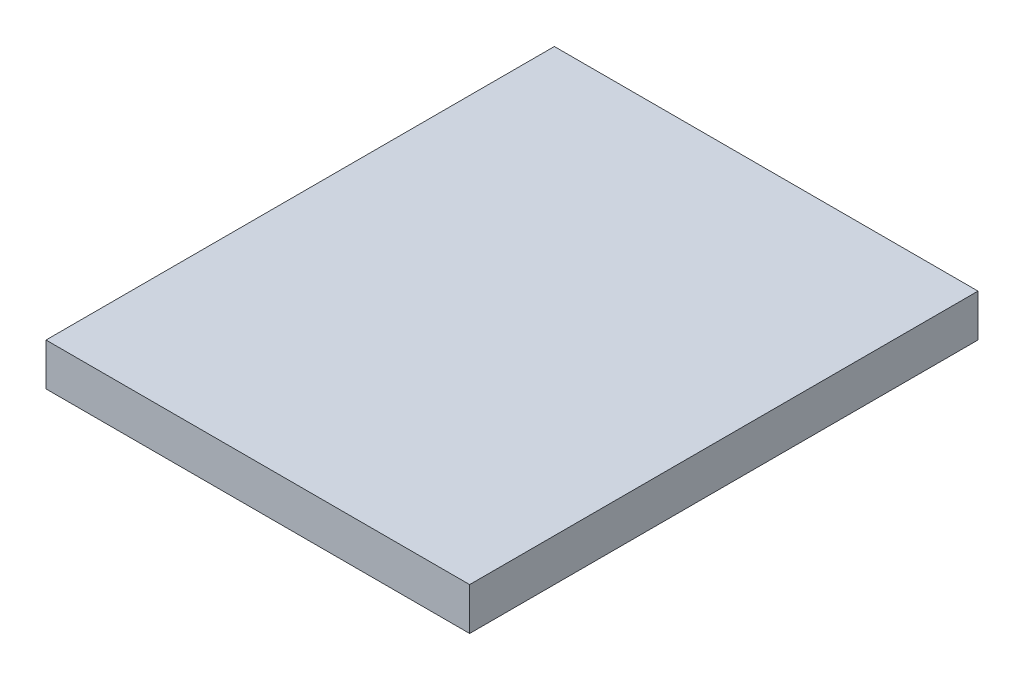
ISO-10303-21;
HEADER;
FILE_DESCRIPTION(('STEP AP214'),'2;1');
FILE_NAME('part.step','',(''),(''),'','','');
FILE_SCHEMA(('AUTOMOTIVE_DESIGN { 1 0 10303 214 1 1 1 1 }'));
ENDSEC;
DATA;
#1=APPLICATION_CONTEXT('core data for automotive mechanical design processes');
#2=APPLICATION_PROTOCOL_DEFINITION('international standard','automotive_design',2000,#1);
#3=PRODUCT_CONTEXT('',#1,'mechanical');
#4=PRODUCT('Part','Part','',(#3));
#5=PRODUCT_RELATED_PRODUCT_CATEGORY('part','',(#4));
#6=PRODUCT_DEFINITION_FORMATION('','',#4);
#7=PRODUCT_DEFINITION_CONTEXT('part definition',#1,'design');
#8=PRODUCT_DEFINITION('design','',#6,#7);
#9=PRODUCT_DEFINITION_SHAPE('','',#8);
#10=(LENGTH_UNIT() NAMED_UNIT(*) SI_UNIT(.MILLI.,.METRE.));
#11=(NAMED_UNIT(*) PLANE_ANGLE_UNIT() SI_UNIT($,.RADIAN.));
#12=(NAMED_UNIT(*) SI_UNIT($,.STERADIAN.) SOLID_ANGLE_UNIT());
#13=UNCERTAINTY_MEASURE_WITH_UNIT(LENGTH_MEASURE(1.E-05),#10,'distance_accuracy_value','');
#14=(GEOMETRIC_REPRESENTATION_CONTEXT(3) GLOBAL_UNCERTAINTY_ASSIGNED_CONTEXT((#13)) GLOBAL_UNIT_ASSIGNED_CONTEXT((#10,
#11,#12)) REPRESENTATION_CONTEXT('',''));
#15=CARTESIAN_POINT('',(0.,0.,0.));
#16=DIRECTION('',(0.,0.,1.));
#17=DIRECTION('',(1.,0.,0.));
#18=AXIS2_PLACEMENT_3D('',#15,#16,#17);
#19=CARTESIAN_POINT('',(0.,1.5875,0.));
#20=DIRECTION('',(1.,0.,0.));
#21=DIRECTION('',(0.,0.,-1.));
#22=AXIS2_PLACEMENT_3D('',#19,#20,#21);
#23=PLANE('',#22);
#24=DIRECTION('',(0.,0.,1.));
#25=VECTOR('',#24,1.);
#26=CARTESIAN_POINT('',(0.,0.,0.));
#27=LINE('',#26,#25);
#28=CARTESIAN_POINT('',(0.,0.,-19.05));
#29=VERTEX_POINT('',#28);
#30=CARTESIAN_POINT('',(0.,0.,0.));
#31=VERTEX_POINT('',#30);
#32=EDGE_CURVE('E96',#29,#31,#27,.T.);
#33=ORIENTED_EDGE('',*,*,#32,.T.);
#34=DIRECTION('',(0.,-1.,0.));
#35=VECTOR('',#34,1.);
#36=CARTESIAN_POINT('',(0.,1.5875,0.));
#37=LINE('',#36,#35);
#38=CARTESIAN_POINT('',(0.,1.5875,0.));
#39=VERTEX_POINT('',#38);
#40=EDGE_CURVE('E11',#39,#31,#37,.T.);
#41=ORIENTED_EDGE('',*,*,#40,.F.);
#42=DIRECTION('',(0.,0.,1.));
#43=VECTOR('',#42,1.);
#44=CARTESIAN_POINT('',(0.,1.5875,0.));
#45=LINE('',#44,#43);
#46=CARTESIAN_POINT('',(0.,1.5875,-19.05));
#47=VERTEX_POINT('',#46);
#48=EDGE_CURVE('E84',#47,#39,#45,.T.);
#49=ORIENTED_EDGE('',*,*,#48,.F.);
#50=DIRECTION('',(0.,-1.,0.));
#51=VECTOR('',#50,1.);
#52=CARTESIAN_POINT('',(0.,1.5875,-19.05));
#53=LINE('',#52,#51);
#54=EDGE_CURVE('E92',#47,#29,#53,.T.);
#55=ORIENTED_EDGE('',*,*,#54,.T.);
#56=EDGE_LOOP('',(#33,#41,#49,#55));
#57=FACE_BOUND('',#56,.T.);
#58=ADVANCED_FACE('F33',(#57),#23,.F.);
#59=CARTESIAN_POINT('',(0.,1.5875,0.));
#60=DIRECTION('',(0.,0.,-1.));
#61=DIRECTION('',(-1.,0.,0.));
#62=AXIS2_PLACEMENT_3D('',#59,#60,#61);
#63=PLANE('',#62);
#64=DIRECTION('',(1.,0.,0.));
#65=VECTOR('',#64,1.);
#66=CARTESIAN_POINT('',(0.,0.,0.));
#67=LINE('',#66,#65);
#68=CARTESIAN_POINT('',(15.875,0.,0.));
#69=VERTEX_POINT('',#68);
#70=EDGE_CURVE('E88',#31,#69,#67,.T.);
#71=ORIENTED_EDGE('',*,*,#70,.T.);
#72=DIRECTION('',(0.,-1.,0.));
#73=VECTOR('',#72,1.);
#74=CARTESIAN_POINT('',(15.875,1.5875,0.));
#75=LINE('',#74,#73);
#76=CARTESIAN_POINT('',(15.875,1.5875,0.));
#77=VERTEX_POINT('',#76);
#78=EDGE_CURVE('E41',#77,#69,#75,.T.);
#79=ORIENTED_EDGE('',*,*,#78,.F.);
#80=DIRECTION('',(1.,0.,0.));
#81=VECTOR('',#80,1.);
#82=CARTESIAN_POINT('',(0.,1.5875,0.));
#83=LINE('',#82,#81);
#84=EDGE_CURVE('E79',#39,#77,#83,.T.);
#85=ORIENTED_EDGE('',*,*,#84,.F.);
#86=ORIENTED_EDGE('',*,*,#40,.T.);
#87=EDGE_LOOP('',(#71,#79,#85,#86));
#88=FACE_BOUND('',#87,.T.);
#89=ADVANCED_FACE('F87',(#88),#63,.F.);
#90=CARTESIAN_POINT('',(15.875,1.5875,0.));
#91=DIRECTION('',(-1.,0.,0.));
#92=DIRECTION('',(0.,0.,1.));
#93=AXIS2_PLACEMENT_3D('',#90,#91,#92);
#94=PLANE('',#93);
#95=DIRECTION('',(0.,0.,-1.));
#96=VECTOR('',#95,1.);
#97=CARTESIAN_POINT('',(15.875,0.,0.));
#98=LINE('',#97,#96);
#99=CARTESIAN_POINT('',(15.875,0.,-19.05));
#100=VERTEX_POINT('',#99);
#101=EDGE_CURVE('E66',#69,#100,#98,.T.);
#102=ORIENTED_EDGE('',*,*,#101,.T.);
#103=DIRECTION('',(0.,-1.,0.));
#104=VECTOR('',#103,1.);
#105=CARTESIAN_POINT('',(15.875,1.5875,-19.05));
#106=LINE('',#105,#104);
#107=CARTESIAN_POINT('',(15.875,1.5875,-19.05));
#108=VERTEX_POINT('',#107);
#109=EDGE_CURVE('E89',#108,#100,#106,.T.);
#110=ORIENTED_EDGE('',*,*,#109,.F.);
#111=DIRECTION('',(0.,0.,-1.));
#112=VECTOR('',#111,1.);
#113=CARTESIAN_POINT('',(15.875,1.5875,0.));
#114=LINE('',#113,#112);
#115=EDGE_CURVE('E82',#77,#108,#114,.T.);
#116=ORIENTED_EDGE('',*,*,#115,.F.);
#117=ORIENTED_EDGE('',*,*,#78,.T.);
#118=EDGE_LOOP('',(#102,#110,#116,#117));
#119=FACE_BOUND('',#118,.T.);
#120=ADVANCED_FACE('F90',(#119),#94,.F.);
#121=CARTESIAN_POINT('',(0.,1.5875,-19.05));
#122=DIRECTION('',(0.,0.,1.));
#123=DIRECTION('',(1.,0.,0.));
#124=AXIS2_PLACEMENT_3D('',#121,#122,#123);
#125=PLANE('',#124);
#126=DIRECTION('',(-1.,0.,0.));
#127=VECTOR('',#126,1.);
#128=CARTESIAN_POINT('',(0.,0.,-19.05));
#129=LINE('',#128,#127);
#130=EDGE_CURVE('E72',#100,#29,#129,.T.);
#131=ORIENTED_EDGE('',*,*,#130,.T.);
#132=ORIENTED_EDGE('',*,*,#54,.F.);
#133=DIRECTION('',(-1.,0.,0.));
#134=VECTOR('',#133,1.);
#135=CARTESIAN_POINT('',(0.,1.5875,-19.05));
#136=LINE('',#135,#134);
#137=EDGE_CURVE('E49',#108,#47,#136,.T.);
#138=ORIENTED_EDGE('',*,*,#137,.F.);
#139=ORIENTED_EDGE('',*,*,#109,.T.);
#140=EDGE_LOOP('',(#131,#132,#138,#139));
#141=FACE_BOUND('',#140,.T.);
#142=ADVANCED_FACE('F103',(#141),#125,.F.);
#143=CARTESIAN_POINT('',(0.,1.5875,0.));
#144=DIRECTION('',(0.,-1.,0.));
#145=DIRECTION('',(0.,0.,-1.));
#146=AXIS2_PLACEMENT_3D('',#143,#144,#145);
#147=PLANE('',#146);
#148=ORIENTED_EDGE('',*,*,#48,.T.);
#149=ORIENTED_EDGE('',*,*,#84,.T.);
#150=ORIENTED_EDGE('',*,*,#115,.T.);
#151=ORIENTED_EDGE('',*,*,#137,.T.);
#152=EDGE_LOOP('',(#148,#149,#150,#151));
#153=FACE_BOUND('',#152,.T.);
#154=ADVANCED_FACE('F80',(#153),#147,.F.);
#155=CARTESIAN_POINT('',(0.,0.,0.));
#156=DIRECTION('',(0.,-1.,0.));
#157=DIRECTION('',(0.,0.,-1.));
#158=AXIS2_PLACEMENT_3D('',#155,#156,#157);
#159=PLANE('',#158);
#160=ORIENTED_EDGE('',*,*,#32,.F.);
#161=ORIENTED_EDGE('',*,*,#130,.F.);
#162=ORIENTED_EDGE('',*,*,#101,.F.);
#163=ORIENTED_EDGE('',*,*,#70,.F.);
#164=EDGE_LOOP('',(#160,#161,#162,#163));
#165=FACE_BOUND('',#164,.T.);
#166=ADVANCED_FACE('F106',(#165),#159,.T.);
#167=CLOSED_SHELL('',(#58,#89,#120,#142,#154,#166));
#168=MANIFOLD_SOLID_BREP('B2',#167);
#169=ADVANCED_BREP_SHAPE_REPRESENTATION('',(#18,#168),#14);
#170=SHAPE_DEFINITION_REPRESENTATION(#9,#169);
ENDSEC;
END-ISO-10303-21;
